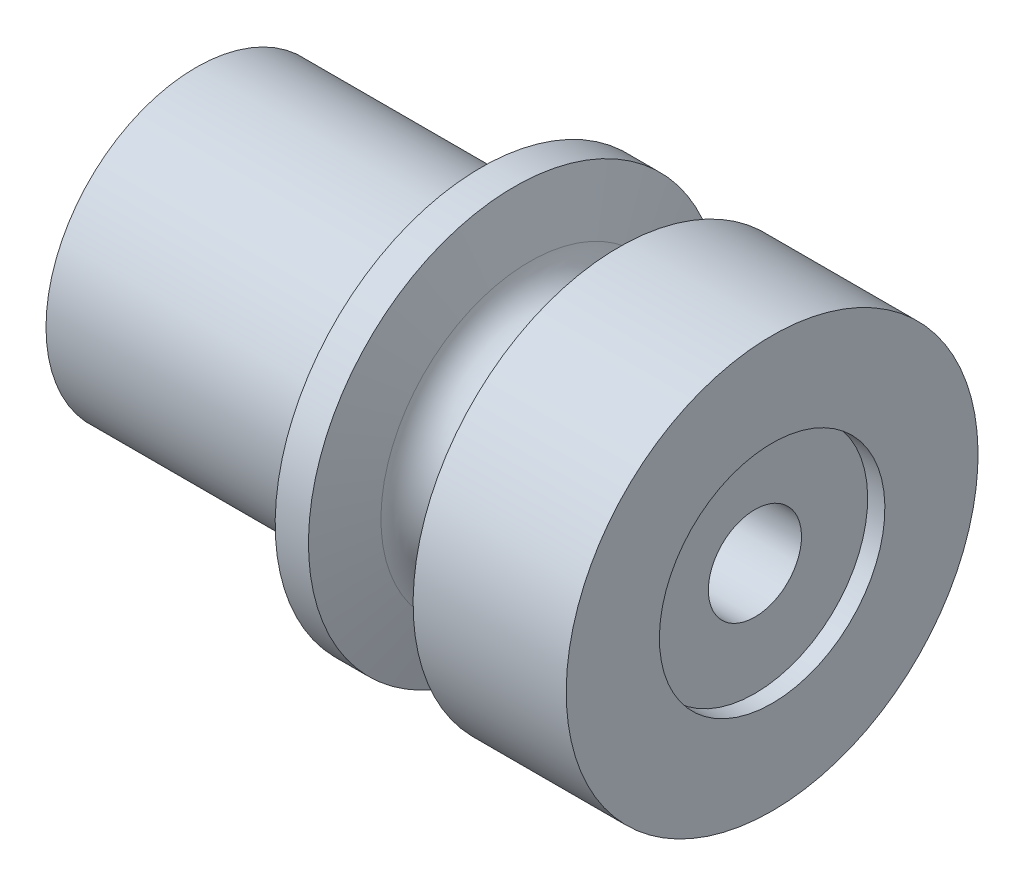
ISO-10303-21;
HEADER;
FILE_DESCRIPTION(('STEP AP214'),'2;1');
FILE_NAME('part.step','',(''),(''),'','','');
FILE_SCHEMA(('AUTOMOTIVE_DESIGN { 1 0 10303 214 1 1 1 1 }'));
ENDSEC;
DATA;
#1=APPLICATION_CONTEXT('core data for automotive mechanical design processes');
#2=APPLICATION_PROTOCOL_DEFINITION('international standard','automotive_design',2000,#1);
#3=PRODUCT_CONTEXT('',#1,'mechanical');
#4=PRODUCT('Part','Part','',(#3));
#5=PRODUCT_RELATED_PRODUCT_CATEGORY('part','',(#4));
#6=PRODUCT_DEFINITION_FORMATION('','',#4);
#7=PRODUCT_DEFINITION_CONTEXT('part definition',#1,'design');
#8=PRODUCT_DEFINITION('design','',#6,#7);
#9=PRODUCT_DEFINITION_SHAPE('','',#8);
#10=(LENGTH_UNIT() NAMED_UNIT(*) SI_UNIT(.MILLI.,.METRE.));
#11=(NAMED_UNIT(*) PLANE_ANGLE_UNIT() SI_UNIT($,.RADIAN.));
#12=(NAMED_UNIT(*) SI_UNIT($,.STERADIAN.) SOLID_ANGLE_UNIT());
#13=UNCERTAINTY_MEASURE_WITH_UNIT(LENGTH_MEASURE(1.E-05),#10,'distance_accuracy_value','');
#14=(GEOMETRIC_REPRESENTATION_CONTEXT(3) GLOBAL_UNCERTAINTY_ASSIGNED_CONTEXT((#13)) GLOBAL_UNIT_ASSIGNED_CONTEXT((#10,
#11,#12)) REPRESENTATION_CONTEXT('',''));
#15=CARTESIAN_POINT('',(0.,0.,0.));
#16=DIRECTION('',(0.,0.,1.));
#17=DIRECTION('',(1.,0.,0.));
#18=AXIS2_PLACEMENT_3D('',#15,#16,#17);
#19=CARTESIAN_POINT('',(-9.75208931130335,0.,0.));
#20=DIRECTION('',(-1.,0.,0.));
#21=DIRECTION('',(0.,-1.,0.));
#22=AXIS2_PLACEMENT_3D('',#19,#20,#21);
#23=TOROIDAL_SURFACE('',#22,8.220075,1.98437499999999);
#24=CARTESIAN_POINT('',(-11.6688483728457,0.,0.));
#25=DIRECTION('',(-1.,0.,0.));
#26=DIRECTION('',(0.,-1.,0.));
#27=AXIS2_PLACEMENT_3D('',#24,#25,#26);
#28=CIRCLE('',#27,7.70648095737468);
#29=CARTESIAN_POINT('',(-11.6688483728457,-7.70648095737468,0.));
#30=VERTEX_POINT('',#29);
#31=EDGE_CURVE('E10',#30,#30,#28,.T.);
#32=ORIENTED_EDGE('',*,*,#31,.F.);
#33=EDGE_LOOP('',(#32));
#34=FACE_BOUND('',#33,.T.);
#35=CARTESIAN_POINT('',(-7.83533024976099,0.,0.));
#36=DIRECTION('',(-1.,0.,0.));
#37=DIRECTION('',(0.,-1.,0.));
#38=AXIS2_PLACEMENT_3D('',#35,#36,#37);
#39=CIRCLE('',#38,7.70648095737468);
#40=CARTESIAN_POINT('',(-7.83533024976098,-7.70648095737468,0.));
#41=VERTEX_POINT('',#40);
#42=EDGE_CURVE('E74',#41,#41,#39,.T.);
#43=ORIENTED_EDGE('',*,*,#42,.T.);
#44=EDGE_LOOP('',(#43));
#45=FACE_BOUND('',#44,.T.);
#46=ADVANCED_FACE('F31',(#34,#45),#23,.F.);
#47=CARTESIAN_POINT('',(-11.6688483728457,0.,0.));
#48=DIRECTION('',(-1.,0.,0.));
#49=DIRECTION('',(0.,-1.,0.));
#50=AXIS2_PLACEMENT_3D('',#47,#48,#49);
#51=CONICAL_SURFACE('',#50,7.70648095737468,1.30899693899574);
#52=CARTESIAN_POINT('',(-12.4623850086866,0.,0.));
#53=DIRECTION('',(-1.,0.,0.));
#54=DIRECTION('',(0.,-1.,0.));
#55=AXIS2_PLACEMENT_3D('',#52,#53,#54);
#56=CIRCLE('',#55,10.668);
#57=CARTESIAN_POINT('',(-12.4623850086866,-10.668,0.));
#58=VERTEX_POINT('',#57);
#59=EDGE_CURVE('E37',#58,#58,#56,.T.);
#60=ORIENTED_EDGE('',*,*,#59,.F.);
#61=EDGE_LOOP('',(#60));
#62=FACE_BOUND('',#61,.T.);
#63=ORIENTED_EDGE('',*,*,#31,.T.);
#64=EDGE_LOOP('',(#63));
#65=FACE_BOUND('',#64,.T.);
#66=ADVANCED_FACE('F141',(#62,#65),#51,.T.);
#67=CARTESIAN_POINT('',(-22.598839252879,0.,0.));
#68=DIRECTION('',(-1.,0.,0.));
#69=DIRECTION('',(0.,-1.,0.));
#70=AXIS2_PLACEMENT_3D('',#67,#68,#69);
#71=CYLINDRICAL_SURFACE('',#70,10.668);
#72=CARTESIAN_POINT('',(-14.188119198,0.,0.));
#73=DIRECTION('',(-1.,0.,0.));
#74=DIRECTION('',(0.,-1.,0.));
#75=AXIS2_PLACEMENT_3D('',#72,#73,#74);
#76=CIRCLE('',#75,10.668);
#77=CARTESIAN_POINT('',(-14.188119198,-10.668,0.));
#78=VERTEX_POINT('',#77);
#79=EDGE_CURVE('E41',#78,#78,#76,.T.);
#80=ORIENTED_EDGE('',*,*,#79,.F.);
#81=EDGE_LOOP('',(#80));
#82=FACE_BOUND('',#81,.T.);
#83=ORIENTED_EDGE('',*,*,#59,.T.);
#84=EDGE_LOOP('',(#83));
#85=FACE_BOUND('',#84,.T.);
#86=ADVANCED_FACE('F136',(#82,#85),#71,.T.);
#87=CARTESIAN_POINT('',(-14.188119198,7.7724,0.));
#88=DIRECTION('',(1.,0.,0.));
#89=DIRECTION('',(0.,1.,0.));
#90=AXIS2_PLACEMENT_3D('',#87,#88,#89);
#91=PLANE('',#90);
#92=CARTESIAN_POINT('',(-14.188119198,0.,0.));
#93=DIRECTION('',(-1.,0.,0.));
#94=DIRECTION('',(0.,-1.,0.));
#95=AXIS2_PLACEMENT_3D('',#92,#93,#94);
#96=CIRCLE('',#95,7.7724);
#97=CARTESIAN_POINT('',(-14.188119198,-7.7724,0.));
#98=VERTEX_POINT('',#97);
#99=EDGE_CURVE('E45',#98,#98,#96,.T.);
#100=ORIENTED_EDGE('',*,*,#99,.F.);
#101=EDGE_LOOP('',(#100));
#102=FACE_BOUND('',#101,.T.);
#103=ORIENTED_EDGE('',*,*,#79,.T.);
#104=EDGE_LOOP('',(#103));
#105=FACE_BOUND('',#104,.T.);
#106=ADVANCED_FACE('F130',(#102,#105),#91,.F.);
#107=CARTESIAN_POINT('',(-22.598839252879,0.,0.));
#108=DIRECTION('',(-1.,0.,0.));
#109=DIRECTION('',(0.,-1.,0.));
#110=AXIS2_PLACEMENT_3D('',#107,#108,#109);
#111=CYLINDRICAL_SURFACE('',#110,7.7724);
#112=CARTESIAN_POINT('',(-28.956,0.,0.));
#113=DIRECTION('',(-1.,0.,0.));
#114=DIRECTION('',(0.,-1.,0.));
#115=AXIS2_PLACEMENT_3D('',#112,#113,#114);
#116=CIRCLE('',#115,7.7724);
#117=CARTESIAN_POINT('',(-28.956,-7.7724,0.));
#118=VERTEX_POINT('',#117);
#119=EDGE_CURVE('E50',#118,#118,#116,.T.);
#120=ORIENTED_EDGE('',*,*,#119,.F.);
#121=EDGE_LOOP('',(#120));
#122=FACE_BOUND('',#121,.T.);
#123=ORIENTED_EDGE('',*,*,#99,.T.);
#124=EDGE_LOOP('',(#123));
#125=FACE_BOUND('',#124,.T.);
#126=ADVANCED_FACE('F124',(#122,#125),#111,.T.);
#127=CARTESIAN_POINT('',(-28.956,7.7724,0.));
#128=DIRECTION('',(1.,0.,0.));
#129=DIRECTION('',(0.,1.,0.));
#130=AXIS2_PLACEMENT_3D('',#127,#128,#129);
#131=PLANE('',#130);
#132=CARTESIAN_POINT('',(-28.956,0.,0.));
#133=DIRECTION('',(-1.,0.,0.));
#134=DIRECTION('',(0.,-1.,0.));
#135=AXIS2_PLACEMENT_3D('',#132,#133,#134);
#136=CIRCLE('',#135,6.7564);
#137=CARTESIAN_POINT('',(-28.956,-6.7564,0.));
#138=VERTEX_POINT('',#137);
#139=EDGE_CURVE('E53',#138,#138,#136,.T.);
#140=ORIENTED_EDGE('',*,*,#139,.F.);
#141=EDGE_LOOP('',(#140));
#142=FACE_BOUND('',#141,.T.);
#143=ORIENTED_EDGE('',*,*,#119,.T.);
#144=EDGE_LOOP('',(#143));
#145=FACE_BOUND('',#144,.T.);
#146=ADVANCED_FACE('F118',(#142,#145),#131,.F.);
#147=CARTESIAN_POINT('',(-28.956,0.,0.));
#148=DIRECTION('',(-1.,0.,0.));
#149=DIRECTION('',(0.,-1.,0.));
#150=AXIS2_PLACEMENT_3D('',#147,#148,#149);
#151=CONICAL_SURFACE('',#150,6.7564,0.78539816339745);
#152=CARTESIAN_POINT('',(-24.6126,0.,0.));
#153=DIRECTION('',(-1.,0.,0.));
#154=DIRECTION('',(0.,-1.,0.));
#155=AXIS2_PLACEMENT_3D('',#152,#153,#154);
#156=CIRCLE('',#155,2.413);
#157=CARTESIAN_POINT('',(-24.6126,-2.413,0.));
#158=VERTEX_POINT('',#157);
#159=EDGE_CURVE('E56',#158,#158,#156,.T.);
#160=ORIENTED_EDGE('',*,*,#159,.F.);
#161=EDGE_LOOP('',(#160));
#162=FACE_BOUND('',#161,.T.);
#163=ORIENTED_EDGE('',*,*,#139,.T.);
#164=EDGE_LOOP('',(#163));
#165=FACE_BOUND('',#164,.T.);
#166=ADVANCED_FACE('F112',(#162,#165),#151,.F.);
#167=CARTESIAN_POINT('',(-22.598839252879,0.,0.));
#168=DIRECTION('',(-1.,0.,0.));
#169=DIRECTION('',(0.,-1.,0.));
#170=AXIS2_PLACEMENT_3D('',#167,#168,#169);
#171=CYLINDRICAL_SURFACE('',#170,2.413);
#172=CARTESIAN_POINT('',(0.,0.,0.));
#173=DIRECTION('',(-1.,0.,0.));
#174=DIRECTION('',(0.,-1.,0.));
#175=AXIS2_PLACEMENT_3D('',#172,#173,#174);
#176=CIRCLE('',#175,2.413);
#177=CARTESIAN_POINT('',(0.,-2.41299999999999,0.));
#178=VERTEX_POINT('',#177);
#179=EDGE_CURVE('E59',#178,#178,#176,.T.);
#180=ORIENTED_EDGE('',*,*,#179,.F.);
#181=EDGE_LOOP('',(#180));
#182=FACE_BOUND('',#181,.T.);
#183=ORIENTED_EDGE('',*,*,#159,.T.);
#184=EDGE_LOOP('',(#183));
#185=FACE_BOUND('',#184,.T.);
#186=ADVANCED_FACE('F106',(#182,#185),#171,.F.);
#187=CARTESIAN_POINT('',(0.,2.413,0.));
#188=DIRECTION('',(-1.,0.,0.));
#189=DIRECTION('',(0.,-1.,0.));
#190=AXIS2_PLACEMENT_3D('',#187,#188,#189);
#191=PLANE('',#190);
#192=CARTESIAN_POINT('',(0.,0.,0.));
#193=DIRECTION('',(-1.,0.,0.));
#194=DIRECTION('',(0.,-1.,0.));
#195=AXIS2_PLACEMENT_3D('',#192,#193,#194);
#196=CIRCLE('',#195,5.842);
#197=CARTESIAN_POINT('',(0.,-5.842,0.));
#198=VERTEX_POINT('',#197);
#199=EDGE_CURVE('E62',#198,#198,#196,.T.);
#200=ORIENTED_EDGE('',*,*,#199,.F.);
#201=EDGE_LOOP('',(#200));
#202=FACE_BOUND('',#201,.T.);
#203=ORIENTED_EDGE('',*,*,#179,.T.);
#204=EDGE_LOOP('',(#203));
#205=FACE_BOUND('',#204,.T.);
#206=ADVANCED_FACE('F100',(#202,#205),#191,.F.);
#207=CARTESIAN_POINT('',(-22.598839252879,0.,0.));
#208=DIRECTION('',(-1.,0.,0.));
#209=DIRECTION('',(0.,-1.,0.));
#210=AXIS2_PLACEMENT_3D('',#207,#208,#209);
#211=CYLINDRICAL_SURFACE('',#210,5.842);
#212=CARTESIAN_POINT('',(0.892,0.,0.));
#213=DIRECTION('',(-1.,0.,0.));
#214=DIRECTION('',(0.,-1.,0.));
#215=AXIS2_PLACEMENT_3D('',#212,#213,#214);
#216=CIRCLE('',#215,5.842);
#217=CARTESIAN_POINT('',(0.892000000000001,-5.842,0.));
#218=VERTEX_POINT('',#217);
#219=EDGE_CURVE('E65',#218,#218,#216,.T.);
#220=ORIENTED_EDGE('',*,*,#219,.F.);
#221=EDGE_LOOP('',(#220));
#222=FACE_BOUND('',#221,.T.);
#223=ORIENTED_EDGE('',*,*,#199,.T.);
#224=EDGE_LOOP('',(#223));
#225=FACE_BOUND('',#224,.T.);
#226=ADVANCED_FACE('F94',(#222,#225),#211,.F.);
#227=CARTESIAN_POINT('',(0.891999999999999,10.668,0.));
#228=DIRECTION('',(-1.,0.,0.));
#229=DIRECTION('',(0.,-1.,0.));
#230=AXIS2_PLACEMENT_3D('',#227,#228,#229);
#231=PLANE('',#230);
#232=CARTESIAN_POINT('',(0.892,0.,0.));
#233=DIRECTION('',(-1.,0.,0.));
#234=DIRECTION('',(0.,-1.,0.));
#235=AXIS2_PLACEMENT_3D('',#232,#233,#234);
#236=CIRCLE('',#235,10.668);
#237=CARTESIAN_POINT('',(0.892000000000002,-10.668,0.));
#238=VERTEX_POINT('',#237);
#239=EDGE_CURVE('E68',#238,#238,#236,.T.);
#240=ORIENTED_EDGE('',*,*,#239,.F.);
#241=EDGE_LOOP('',(#240));
#242=FACE_BOUND('',#241,.T.);
#243=ORIENTED_EDGE('',*,*,#219,.T.);
#244=EDGE_LOOP('',(#243));
#245=FACE_BOUND('',#244,.T.);
#246=ADVANCED_FACE('F88',(#242,#245),#231,.F.);
#247=CARTESIAN_POINT('',(-22.598839252879,0.,0.));
#248=DIRECTION('',(-1.,0.,0.));
#249=DIRECTION('',(0.,-1.,0.));
#250=AXIS2_PLACEMENT_3D('',#247,#248,#249);
#251=CYLINDRICAL_SURFACE('',#250,10.668);
#252=CARTESIAN_POINT('',(-7.04179361392012,0.,0.));
#253=DIRECTION('',(-1.,0.,0.));
#254=DIRECTION('',(0.,-1.,0.));
#255=AXIS2_PLACEMENT_3D('',#252,#253,#254);
#256=CIRCLE('',#255,10.668);
#257=CARTESIAN_POINT('',(-7.04179361392012,-10.668,0.));
#258=VERTEX_POINT('',#257);
#259=EDGE_CURVE('E71',#258,#258,#256,.T.);
#260=ORIENTED_EDGE('',*,*,#259,.F.);
#261=EDGE_LOOP('',(#260));
#262=FACE_BOUND('',#261,.T.);
#263=ORIENTED_EDGE('',*,*,#239,.T.);
#264=EDGE_LOOP('',(#263));
#265=FACE_BOUND('',#264,.T.);
#266=ADVANCED_FACE('F82',(#262,#265),#251,.T.);
#267=CARTESIAN_POINT('',(-7.04179361392012,0.,0.));
#268=DIRECTION('',(1.,0.,0.));
#269=DIRECTION('',(0.,1.,0.));
#270=AXIS2_PLACEMENT_3D('',#267,#268,#269);
#271=CONICAL_SURFACE('',#270,10.668,1.30899693899574);
#272=ORIENTED_EDGE('',*,*,#42,.F.);
#273=EDGE_LOOP('',(#272));
#274=FACE_BOUND('',#273,.T.);
#275=ORIENTED_EDGE('',*,*,#259,.T.);
#276=EDGE_LOOP('',(#275));
#277=FACE_BOUND('',#276,.T.);
#278=ADVANCED_FACE('F79',(#274,#277),#271,.T.);
#279=CLOSED_SHELL('',(#46,#66,#86,#106,#126,#146,#166,#186,#206,#226,#246,#266,#278));
#280=MANIFOLD_SOLID_BREP('B2',#279);
#281=ADVANCED_BREP_SHAPE_REPRESENTATION('',(#18,#280),#14);
#282=SHAPE_DEFINITION_REPRESENTATION(#9,#281);
ENDSEC;
END-ISO-10303-21;
